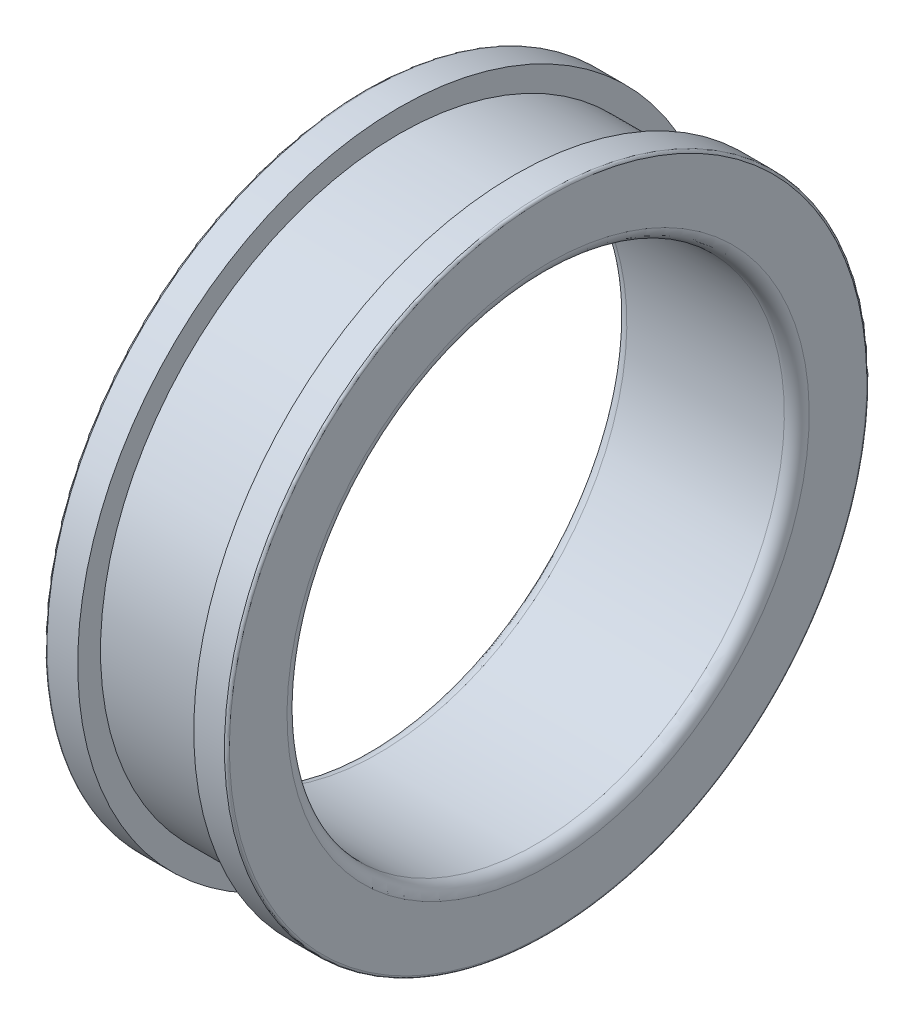
ISO-10303-21;
HEADER;
FILE_DESCRIPTION(('STEP AP214'),'2;1');
FILE_NAME('part.step','',(''),(''),'','','');
FILE_SCHEMA(('AUTOMOTIVE_DESIGN { 1 0 10303 214 1 1 1 1 }'));
ENDSEC;
DATA;
#1=APPLICATION_CONTEXT('core data for automotive mechanical design processes');
#2=APPLICATION_PROTOCOL_DEFINITION('international standard','automotive_design',2000,#1);
#3=PRODUCT_CONTEXT('',#1,'mechanical');
#4=PRODUCT('Part','Part','',(#3));
#5=PRODUCT_RELATED_PRODUCT_CATEGORY('part','',(#4));
#6=PRODUCT_DEFINITION_FORMATION('','',#4);
#7=PRODUCT_DEFINITION_CONTEXT('part definition',#1,'design');
#8=PRODUCT_DEFINITION('design','',#6,#7);
#9=PRODUCT_DEFINITION_SHAPE('','',#8);
#10=(LENGTH_UNIT() NAMED_UNIT(*) SI_UNIT(.MILLI.,.METRE.));
#11=(NAMED_UNIT(*) PLANE_ANGLE_UNIT() SI_UNIT($,.RADIAN.));
#12=(NAMED_UNIT(*) SI_UNIT($,.STERADIAN.) SOLID_ANGLE_UNIT());
#13=UNCERTAINTY_MEASURE_WITH_UNIT(LENGTH_MEASURE(1.E-05),#10,'distance_accuracy_value','');
#14=(GEOMETRIC_REPRESENTATION_CONTEXT(3) GLOBAL_UNCERTAINTY_ASSIGNED_CONTEXT((#13)) GLOBAL_UNIT_ASSIGNED_CONTEXT((#10,
#11,#12)) REPRESENTATION_CONTEXT('',''));
#15=CARTESIAN_POINT('',(0.,0.,0.));
#16=DIRECTION('',(0.,0.,1.));
#17=DIRECTION('',(1.,0.,0.));
#18=AXIS2_PLACEMENT_3D('',#15,#16,#17);
#19=CARTESIAN_POINT('',(19.85,0.,0.));
#20=DIRECTION('',(-1.,0.,0.));
#21=DIRECTION('',(0.,1.,0.));
#22=AXIS2_PLACEMENT_3D('',#19,#20,#21);
#23=CYLINDRICAL_SURFACE('',#22,38.75);
#24=CARTESIAN_POINT('',(18.,0.,0.));
#25=DIRECTION('',(1.,0.,0.));
#26=DIRECTION('',(0.,1.,0.));
#27=AXIS2_PLACEMENT_3D('',#24,#25,#26);
#28=CIRCLE('',#27,38.75);
#29=CARTESIAN_POINT('',(18.,38.75,0.));
#30=VERTEX_POINT('',#29);
#31=EDGE_CURVE('E11',#30,#30,#28,.T.);
#32=ORIENTED_EDGE('',*,*,#31,.T.);
#33=EDGE_LOOP('',(#32));
#34=FACE_BOUND('',#33,.T.);
#35=CARTESIAN_POINT('',(21.7,0.,0.));
#36=DIRECTION('',(1.,0.,0.));
#37=DIRECTION('',(0.,1.,0.));
#38=AXIS2_PLACEMENT_3D('',#35,#36,#37);
#39=CIRCLE('',#38,38.75);
#40=CARTESIAN_POINT('',(21.7,38.75,0.));
#41=VERTEX_POINT('',#40);
#42=EDGE_CURVE('E79',#41,#41,#39,.T.);
#43=ORIENTED_EDGE('',*,*,#42,.F.);
#44=EDGE_LOOP('',(#43));
#45=FACE_BOUND('',#44,.T.);
#46=ADVANCED_FACE('F17',(#34,#45),#23,.T.);
#47=CARTESIAN_POINT('',(18.,37.375,0.));
#48=DIRECTION('',(-1.,0.,0.));
#49=DIRECTION('',(0.,-1.,0.));
#50=AXIS2_PLACEMENT_3D('',#47,#48,#49);
#51=PLANE('',#50);
#52=CARTESIAN_POINT('',(18.,0.,0.));
#53=DIRECTION('',(1.,0.,0.));
#54=DIRECTION('',(0.,1.,0.));
#55=AXIS2_PLACEMENT_3D('',#52,#53,#54);
#56=CIRCLE('',#55,36.);
#57=CARTESIAN_POINT('',(18.,36.,0.));
#58=VERTEX_POINT('',#57);
#59=EDGE_CURVE('E26',#58,#58,#56,.T.);
#60=ORIENTED_EDGE('',*,*,#59,.T.);
#61=EDGE_LOOP('',(#60));
#62=FACE_BOUND('',#61,.T.);
#63=ORIENTED_EDGE('',*,*,#31,.F.);
#64=EDGE_LOOP('',(#63));
#65=FACE_BOUND('',#64,.T.);
#66=ADVANCED_FACE('F19',(#62,#65),#51,.T.);
#67=CARTESIAN_POINT('',(11.,0.,0.));
#68=DIRECTION('',(-1.,0.,0.));
#69=DIRECTION('',(0.,1.,0.));
#70=AXIS2_PLACEMENT_3D('',#67,#68,#69);
#71=CYLINDRICAL_SURFACE('',#70,36.);
#72=CARTESIAN_POINT('',(4.,0.,0.));
#73=DIRECTION('',(1.,0.,0.));
#74=DIRECTION('',(0.,1.,0.));
#75=AXIS2_PLACEMENT_3D('',#72,#73,#74);
#76=CIRCLE('',#75,36.);
#77=CARTESIAN_POINT('',(4.,36.,0.));
#78=VERTEX_POINT('',#77);
#79=EDGE_CURVE('E81',#78,#78,#76,.T.);
#80=ORIENTED_EDGE('',*,*,#79,.T.);
#81=EDGE_LOOP('',(#80));
#82=FACE_BOUND('',#81,.T.);
#83=ORIENTED_EDGE('',*,*,#59,.F.);
#84=EDGE_LOOP('',(#83));
#85=FACE_BOUND('',#84,.T.);
#86=ADVANCED_FACE('F112',(#82,#85),#71,.T.);
#87=CARTESIAN_POINT('',(4.,37.375,0.));
#88=DIRECTION('',(1.,0.,0.));
#89=DIRECTION('',(0.,1.,0.));
#90=AXIS2_PLACEMENT_3D('',#87,#88,#89);
#91=PLANE('',#90);
#92=CARTESIAN_POINT('',(4.,0.,0.));
#93=DIRECTION('',(1.,0.,0.));
#94=DIRECTION('',(0.,1.,0.));
#95=AXIS2_PLACEMENT_3D('',#92,#93,#94);
#96=CIRCLE('',#95,38.75);
#97=CARTESIAN_POINT('',(4.,38.75,0.));
#98=VERTEX_POINT('',#97);
#99=EDGE_CURVE('E82',#98,#98,#96,.T.);
#100=ORIENTED_EDGE('',*,*,#99,.T.);
#101=EDGE_LOOP('',(#100));
#102=FACE_BOUND('',#101,.T.);
#103=ORIENTED_EDGE('',*,*,#79,.F.);
#104=EDGE_LOOP('',(#103));
#105=FACE_BOUND('',#104,.T.);
#106=ADVANCED_FACE('F137',(#102,#105),#91,.T.);
#107=CARTESIAN_POINT('',(2.15,0.,0.));
#108=DIRECTION('',(-1.,0.,0.));
#109=DIRECTION('',(0.,1.,0.));
#110=AXIS2_PLACEMENT_3D('',#107,#108,#109);
#111=CYLINDRICAL_SURFACE('',#110,38.75);
#112=CARTESIAN_POINT('',(0.3,0.,0.));
#113=DIRECTION('',(1.,0.,0.));
#114=DIRECTION('',(0.,1.,0.));
#115=AXIS2_PLACEMENT_3D('',#112,#113,#114);
#116=CIRCLE('',#115,38.75);
#117=CARTESIAN_POINT('',(0.3,38.75,0.));
#118=VERTEX_POINT('',#117);
#119=EDGE_CURVE('E73',#118,#118,#116,.T.);
#120=ORIENTED_EDGE('',*,*,#119,.T.);
#121=EDGE_LOOP('',(#120));
#122=FACE_BOUND('',#121,.T.);
#123=ORIENTED_EDGE('',*,*,#99,.F.);
#124=EDGE_LOOP('',(#123));
#125=FACE_BOUND('',#124,.T.);
#126=ADVANCED_FACE('F132',(#122,#125),#111,.T.);
#127=CARTESIAN_POINT('',(0.3,0.,0.));
#128=DIRECTION('',(1.,0.,0.));
#129=DIRECTION('',(0.,0.,-1.));
#130=AXIS2_PLACEMENT_3D('',#127,#128,#129);
#131=TOROIDAL_SURFACE('',#130,38.45,0.3);
#132=CARTESIAN_POINT('',(0.,0.,0.));
#133=DIRECTION('',(1.,0.,0.));
#134=DIRECTION('',(0.,1.,0.));
#135=AXIS2_PLACEMENT_3D('',#132,#133,#134);
#136=CIRCLE('',#135,38.45);
#137=CARTESIAN_POINT('',(0.,38.45,0.));
#138=VERTEX_POINT('',#137);
#139=EDGE_CURVE('E70',#138,#138,#136,.T.);
#140=ORIENTED_EDGE('',*,*,#139,.T.);
#141=EDGE_LOOP('',(#140));
#142=FACE_BOUND('',#141,.T.);
#143=ORIENTED_EDGE('',*,*,#119,.F.);
#144=EDGE_LOOP('',(#143));
#145=FACE_BOUND('',#144,.T.);
#146=ADVANCED_FACE('F128',(#142,#145),#131,.T.);
#147=CARTESIAN_POINT('',(0.,34.975,0.));
#148=DIRECTION('',(-1.,0.,0.));
#149=DIRECTION('',(0.,-1.,0.));
#150=AXIS2_PLACEMENT_3D('',#147,#148,#149);
#151=PLANE('',#150);
#152=CARTESIAN_POINT('',(0.,0.,0.));
#153=DIRECTION('',(1.,0.,0.));
#154=DIRECTION('',(0.,1.,0.));
#155=AXIS2_PLACEMENT_3D('',#152,#153,#154);
#156=CIRCLE('',#155,31.5);
#157=CARTESIAN_POINT('',(0.,31.5,0.));
#158=VERTEX_POINT('',#157);
#159=EDGE_CURVE('E66',#158,#158,#156,.T.);
#160=ORIENTED_EDGE('',*,*,#159,.T.);
#161=EDGE_LOOP('',(#160));
#162=FACE_BOUND('',#161,.T.);
#163=ORIENTED_EDGE('',*,*,#139,.F.);
#164=EDGE_LOOP('',(#163));
#165=FACE_BOUND('',#164,.T.);
#166=ADVANCED_FACE('F67',(#162,#165),#151,.T.);
#167=CARTESIAN_POINT('',(1.5,0.,0.));
#168=DIRECTION('',(1.,0.,0.));
#169=DIRECTION('',(0.,0.,-1.));
#170=AXIS2_PLACEMENT_3D('',#167,#168,#169);
#171=TOROIDAL_SURFACE('',#170,31.5,1.5);
#172=CARTESIAN_POINT('',(1.5,0.,0.));
#173=DIRECTION('',(1.,0.,0.));
#174=DIRECTION('',(0.,1.,0.));
#175=AXIS2_PLACEMENT_3D('',#172,#173,#174);
#176=CIRCLE('',#175,30.);
#177=CARTESIAN_POINT('',(1.5,30.,0.));
#178=VERTEX_POINT('',#177);
#179=EDGE_CURVE('E71',#178,#178,#176,.T.);
#180=ORIENTED_EDGE('',*,*,#179,.T.);
#181=EDGE_LOOP('',(#180));
#182=FACE_BOUND('',#181,.T.);
#183=ORIENTED_EDGE('',*,*,#159,.F.);
#184=EDGE_LOOP('',(#183));
#185=FACE_BOUND('',#184,.T.);
#186=ADVANCED_FACE('F120',(#182,#185),#171,.T.);
#187=CARTESIAN_POINT('',(11.,0.,0.));
#188=DIRECTION('',(-1.,0.,0.));
#189=DIRECTION('',(0.,1.,0.));
#190=AXIS2_PLACEMENT_3D('',#187,#188,#189);
#191=CYLINDRICAL_SURFACE('',#190,30.);
#192=CARTESIAN_POINT('',(20.5,0.,0.));
#193=DIRECTION('',(1.,0.,0.));
#194=DIRECTION('',(0.,1.,0.));
#195=AXIS2_PLACEMENT_3D('',#192,#193,#194);
#196=CIRCLE('',#195,30.);
#197=CARTESIAN_POINT('',(20.5,30.,0.));
#198=VERTEX_POINT('',#197);
#199=EDGE_CURVE('E75',#198,#198,#196,.T.);
#200=ORIENTED_EDGE('',*,*,#199,.T.);
#201=EDGE_LOOP('',(#200));
#202=FACE_BOUND('',#201,.T.);
#203=ORIENTED_EDGE('',*,*,#179,.F.);
#204=EDGE_LOOP('',(#203));
#205=FACE_BOUND('',#204,.T.);
#206=ADVANCED_FACE('F117',(#202,#205),#191,.F.);
#207=CARTESIAN_POINT('',(20.5,0.,0.));
#208=DIRECTION('',(1.,0.,0.));
#209=DIRECTION('',(0.,0.,-1.));
#210=AXIS2_PLACEMENT_3D('',#207,#208,#209);
#211=TOROIDAL_SURFACE('',#210,31.5,1.5);
#212=CARTESIAN_POINT('',(22.,0.,0.));
#213=DIRECTION('',(1.,0.,0.));
#214=DIRECTION('',(0.,1.,0.));
#215=AXIS2_PLACEMENT_3D('',#212,#213,#214);
#216=CIRCLE('',#215,31.5);
#217=CARTESIAN_POINT('',(22.,31.5,0.));
#218=VERTEX_POINT('',#217);
#219=EDGE_CURVE('E21',#218,#218,#216,.T.);
#220=ORIENTED_EDGE('',*,*,#219,.T.);
#221=EDGE_LOOP('',(#220));
#222=FACE_BOUND('',#221,.T.);
#223=ORIENTED_EDGE('',*,*,#199,.F.);
#224=EDGE_LOOP('',(#223));
#225=FACE_BOUND('',#224,.T.);
#226=ADVANCED_FACE('F104',(#222,#225),#211,.T.);
#227=CARTESIAN_POINT('',(22.,34.975,0.));
#228=DIRECTION('',(1.,0.,0.));
#229=DIRECTION('',(0.,1.,0.));
#230=AXIS2_PLACEMENT_3D('',#227,#228,#229);
#231=PLANE('',#230);
#232=CARTESIAN_POINT('',(22.,0.,0.));
#233=DIRECTION('',(1.,0.,0.));
#234=DIRECTION('',(0.,1.,0.));
#235=AXIS2_PLACEMENT_3D('',#232,#233,#234);
#236=CIRCLE('',#235,38.45);
#237=CARTESIAN_POINT('',(22.,38.45,0.));
#238=VERTEX_POINT('',#237);
#239=EDGE_CURVE('E80',#238,#238,#236,.T.);
#240=ORIENTED_EDGE('',*,*,#239,.T.);
#241=EDGE_LOOP('',(#240));
#242=FACE_BOUND('',#241,.T.);
#243=ORIENTED_EDGE('',*,*,#219,.F.);
#244=EDGE_LOOP('',(#243));
#245=FACE_BOUND('',#244,.T.);
#246=ADVANCED_FACE('F93',(#242,#245),#231,.T.);
#247=CARTESIAN_POINT('',(21.7,0.,0.));
#248=DIRECTION('',(1.,0.,0.));
#249=DIRECTION('',(0.,0.,-1.));
#250=AXIS2_PLACEMENT_3D('',#247,#248,#249);
#251=TOROIDAL_SURFACE('',#250,38.45,0.3);
#252=ORIENTED_EDGE('',*,*,#42,.T.);
#253=EDGE_LOOP('',(#252));
#254=FACE_BOUND('',#253,.T.);
#255=ORIENTED_EDGE('',*,*,#239,.F.);
#256=EDGE_LOOP('',(#255));
#257=FACE_BOUND('',#256,.T.);
#258=ADVANCED_FACE('F96',(#254,#257),#251,.T.);
#259=CLOSED_SHELL('',(#46,#66,#86,#106,#126,#146,#166,#186,#206,#226,#246,#258));
#260=MANIFOLD_SOLID_BREP('B1',#259);
#261=ADVANCED_BREP_SHAPE_REPRESENTATION('',(#18,#260),#14);
#262=SHAPE_DEFINITION_REPRESENTATION(#9,#261);
ENDSEC;
END-ISO-10303-21;
